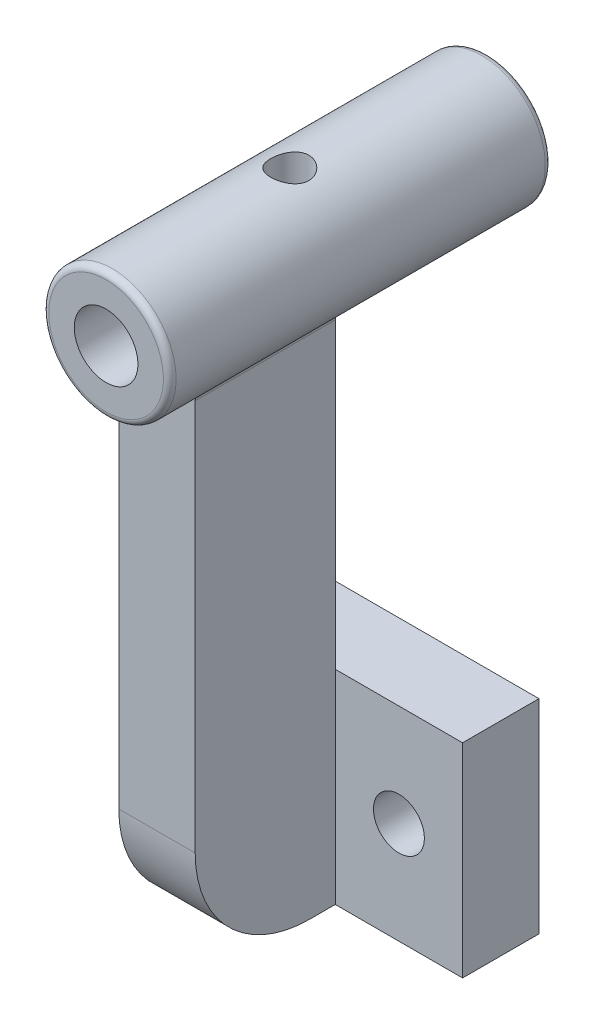
ISO-10303-21;
HEADER;
FILE_DESCRIPTION(('STEP AP214'),'2;1');
FILE_NAME('part.step','',(''),(''),'','','');
FILE_SCHEMA(('AUTOMOTIVE_DESIGN { 1 0 10303 214 1 1 1 1 }'));
ENDSEC;
DATA;
#1=APPLICATION_CONTEXT('core data for automotive mechanical design processes');
#2=APPLICATION_PROTOCOL_DEFINITION('international standard','automotive_design',2000,#1);
#3=PRODUCT_CONTEXT('',#1,'mechanical');
#4=PRODUCT('Part','Part','',(#3));
#5=PRODUCT_RELATED_PRODUCT_CATEGORY('part','',(#4));
#6=PRODUCT_DEFINITION_FORMATION('','',#4);
#7=PRODUCT_DEFINITION_CONTEXT('part definition',#1,'design');
#8=PRODUCT_DEFINITION('design','',#6,#7);
#9=PRODUCT_DEFINITION_SHAPE('','',#8);
#10=(LENGTH_UNIT() NAMED_UNIT(*) SI_UNIT(.MILLI.,.METRE.));
#11=(NAMED_UNIT(*) PLANE_ANGLE_UNIT() SI_UNIT($,.RADIAN.));
#12=(NAMED_UNIT(*) SI_UNIT($,.STERADIAN.) SOLID_ANGLE_UNIT());
#13=UNCERTAINTY_MEASURE_WITH_UNIT(LENGTH_MEASURE(1.E-05),#10,'distance_accuracy_value','');
#14=(GEOMETRIC_REPRESENTATION_CONTEXT(3) GLOBAL_UNCERTAINTY_ASSIGNED_CONTEXT((#13)) GLOBAL_UNIT_ASSIGNED_CONTEXT((#10,
#11,#12)) REPRESENTATION_CONTEXT('',''));
#15=CARTESIAN_POINT('',(0.,0.,0.));
#16=DIRECTION('',(0.,0.,1.));
#17=DIRECTION('',(1.,0.,0.));
#18=AXIS2_PLACEMENT_3D('',#15,#16,#17);
#19=CARTESIAN_POINT('',(0.,0.,6.));
#20=DIRECTION('',(0.,0.,1.));
#21=DIRECTION('',(1.,0.,0.));
#22=AXIS2_PLACEMENT_3D('',#19,#20,#21);
#23=PLANE('',#22);
#24=CARTESIAN_POINT('',(-8.,8.,6.));
#25=DIRECTION('',(0.,0.,1.));
#26=DIRECTION('',(1.,0.,0.));
#27=AXIS2_PLACEMENT_3D('',#24,#25,#26);
#28=CIRCLE('',#27,2.);
#29=CARTESIAN_POINT('',(-6.,8.,6.));
#30=VERTEX_POINT('',#29);
#31=EDGE_CURVE('E179',#30,#30,#28,.T.);
#32=ORIENTED_EDGE('',*,*,#31,.F.);
#33=EDGE_LOOP('',(#32));
#34=FACE_BOUND('',#33,.T.);
#35=DIRECTION('',(-1.,0.,0.));
#36=VECTOR('',#35,1.);
#37=CARTESIAN_POINT('',(0.,0.,6.));
#38=LINE('',#37,#36);
#39=CARTESIAN_POINT('',(-3.,0.,6.));
#40=VERTEX_POINT('',#39);
#41=CARTESIAN_POINT('',(-13.,0.,6.));
#42=VERTEX_POINT('',#41);
#43=EDGE_CURVE('E191',#40,#42,#38,.T.);
#44=ORIENTED_EDGE('',*,*,#43,.F.);
#45=DIRECTION('',(0.,1.,0.));
#46=VECTOR('',#45,1.);
#47=CARTESIAN_POINT('',(-3.,0.,6.));
#48=LINE('',#47,#46);
#49=CARTESIAN_POINT('',(-3.,16.,6.));
#50=VERTEX_POINT('',#49);
#51=EDGE_CURVE('E169',#40,#50,#48,.T.);
#52=ORIENTED_EDGE('',*,*,#51,.T.);
#53=DIRECTION('',(-1.,0.,0.));
#54=VECTOR('',#53,1.);
#55=CARTESIAN_POINT('',(0.,16.,6.));
#56=LINE('',#55,#54);
#57=CARTESIAN_POINT('',(-13.,16.,6.));
#58=VERTEX_POINT('',#57);
#59=EDGE_CURVE('E182',#50,#58,#56,.T.);
#60=ORIENTED_EDGE('',*,*,#59,.T.);
#61=DIRECTION('',(0.,-1.,0.));
#62=VECTOR('',#61,1.);
#63=CARTESIAN_POINT('',(-13.,0.,6.));
#64=LINE('',#63,#62);
#65=EDGE_CURVE('E187',#58,#42,#64,.T.);
#66=ORIENTED_EDGE('',*,*,#65,.T.);
#67=EDGE_LOOP('',(#44,#52,#60,#66));
#68=FACE_BOUND('',#67,.T.);
#69=ADVANCED_FACE('F47',(#34,#68),#23,.T.);
#70=CARTESIAN_POINT('',(0.,16.,6.));
#71=DIRECTION('',(0.,-1.,0.));
#72=DIRECTION('',(1.,0.,0.));
#73=AXIS2_PLACEMENT_3D('',#70,#71,#72);
#74=PLANE('',#73);
#75=DIRECTION('',(-1.,0.,0.));
#76=VECTOR('',#75,1.);
#77=CARTESIAN_POINT('',(0.,16.,0.));
#78=LINE('',#77,#76);
#79=CARTESIAN_POINT('',(13.,16.,0.));
#80=VERTEX_POINT('',#79);
#81=CARTESIAN_POINT('',(-13.,16.,0.));
#82=VERTEX_POINT('',#81);
#83=EDGE_CURVE('E203',#80,#82,#78,.T.);
#84=ORIENTED_EDGE('',*,*,#83,.T.);
#85=DIRECTION('',(0.,0.,-1.));
#86=VECTOR('',#85,1.);
#87=CARTESIAN_POINT('',(-13.,16.,6.));
#88=LINE('',#87,#86);
#89=EDGE_CURVE('E222',#58,#82,#88,.T.);
#90=ORIENTED_EDGE('',*,*,#89,.F.);
#91=ORIENTED_EDGE('',*,*,#59,.F.);
#92=CARTESIAN_POINT('',(3.,16.,6.));
#93=VERTEX_POINT('',#92);
#94=EDGE_CURVE('E188',#93,#50,#56,.T.);
#95=ORIENTED_EDGE('',*,*,#94,.F.);
#96=CARTESIAN_POINT('',(13.,16.,6.));
#97=VERTEX_POINT('',#96);
#98=EDGE_CURVE('E184',#97,#93,#56,.T.);
#99=ORIENTED_EDGE('',*,*,#98,.F.);
#100=DIRECTION('',(0.,0.,-1.));
#101=VECTOR('',#100,1.);
#102=CARTESIAN_POINT('',(13.,16.,6.));
#103=LINE('',#102,#101);
#104=EDGE_CURVE('E200',#97,#80,#103,.T.);
#105=ORIENTED_EDGE('',*,*,#104,.T.);
#106=EDGE_LOOP('',(#84,#90,#91,#95,#99,#105));
#107=FACE_BOUND('',#106,.T.);
#108=ADVANCED_FACE('F271',(#107),#74,.F.);
#109=CARTESIAN_POINT('',(-13.,0.,6.));
#110=DIRECTION('',(1.,0.,0.));
#111=DIRECTION('',(0.,1.,0.));
#112=AXIS2_PLACEMENT_3D('',#109,#110,#111);
#113=PLANE('',#112);
#114=DIRECTION('',(0.,-1.,0.));
#115=VECTOR('',#114,1.);
#116=CARTESIAN_POINT('',(-13.,0.,0.));
#117=LINE('',#116,#115);
#118=CARTESIAN_POINT('',(-13.,0.,0.));
#119=VERTEX_POINT('',#118);
#120=EDGE_CURVE('E206',#82,#119,#117,.T.);
#121=ORIENTED_EDGE('',*,*,#120,.T.);
#122=DIRECTION('',(0.,0.,-1.));
#123=VECTOR('',#122,1.);
#124=CARTESIAN_POINT('',(-13.,0.,6.));
#125=LINE('',#124,#123);
#126=EDGE_CURVE('E220',#42,#119,#125,.T.);
#127=ORIENTED_EDGE('',*,*,#126,.F.);
#128=ORIENTED_EDGE('',*,*,#65,.F.);
#129=ORIENTED_EDGE('',*,*,#89,.T.);
#130=EDGE_LOOP('',(#121,#127,#128,#129));
#131=FACE_BOUND('',#130,.T.);
#132=ADVANCED_FACE('F289',(#131),#113,.F.);
#133=CARTESIAN_POINT('',(0.,0.,6.));
#134=DIRECTION('',(0.,-1.,0.));
#135=DIRECTION('',(1.,0.,0.));
#136=AXIS2_PLACEMENT_3D('',#133,#134,#135);
#137=PLANE('',#136);
#138=DIRECTION('',(-1.,0.,0.));
#139=VECTOR('',#138,1.);
#140=CARTESIAN_POINT('',(0.,0.,0.));
#141=LINE('',#140,#139);
#142=CARTESIAN_POINT('',(13.,0.,0.));
#143=VERTEX_POINT('',#142);
#144=EDGE_CURVE('E209',#143,#119,#141,.T.);
#145=ORIENTED_EDGE('',*,*,#144,.F.);
#146=DIRECTION('',(0.,0.,-1.));
#147=VECTOR('',#146,1.);
#148=CARTESIAN_POINT('',(13.,0.,6.));
#149=LINE('',#148,#147);
#150=CARTESIAN_POINT('',(13.,0.,6.));
#151=VERTEX_POINT('',#150);
#152=EDGE_CURVE('E218',#151,#143,#149,.T.);
#153=ORIENTED_EDGE('',*,*,#152,.F.);
#154=CARTESIAN_POINT('',(3.,0.,6.));
#155=VERTEX_POINT('',#154);
#156=EDGE_CURVE('E192',#151,#155,#38,.T.);
#157=ORIENTED_EDGE('',*,*,#156,.T.);
#158=DIRECTION('',(0.,0.,-1.));
#159=VECTOR('',#158,1.);
#160=CARTESIAN_POINT('',(3.,0.,6.));
#161=LINE('',#160,#159);
#162=CARTESIAN_POINT('',(3.,0.,7.99999999999994));
#163=VERTEX_POINT('',#162);
#164=EDGE_CURVE('E163',#163,#155,#161,.T.);
#165=ORIENTED_EDGE('',*,*,#164,.F.);
#166=DIRECTION('',(1.,0.,0.));
#167=VECTOR('',#166,1.);
#168=CARTESIAN_POINT('',(-3.,0.,7.99999999999994));
#169=LINE('',#168,#167);
#170=CARTESIAN_POINT('',(-3.,0.,7.99999999999994));
#171=VERTEX_POINT('',#170);
#172=EDGE_CURVE('E159',#171,#163,#169,.T.);
#173=ORIENTED_EDGE('',*,*,#172,.F.);
#174=DIRECTION('',(0.,0.,-1.));
#175=VECTOR('',#174,1.);
#176=CARTESIAN_POINT('',(-3.,0.,6.));
#177=LINE('',#176,#175);
#178=EDGE_CURVE('E160',#171,#40,#177,.T.);
#179=ORIENTED_EDGE('',*,*,#178,.T.);
#180=ORIENTED_EDGE('',*,*,#43,.T.);
#181=ORIENTED_EDGE('',*,*,#126,.T.);
#182=EDGE_LOOP('',(#145,#153,#157,#165,#173,#179,#180,#181));
#183=FACE_BOUND('',#182,.T.);
#184=ADVANCED_FACE('F296',(#183),#137,.T.);
#185=CARTESIAN_POINT('',(13.,0.,6.));
#186=DIRECTION('',(-1.,0.,0.));
#187=DIRECTION('',(0.,0.,1.));
#188=AXIS2_PLACEMENT_3D('',#185,#186,#187);
#189=PLANE('',#188);
#190=DIRECTION('',(0.,1.,0.));
#191=VECTOR('',#190,1.);
#192=CARTESIAN_POINT('',(13.,0.,0.));
#193=LINE('',#192,#191);
#194=EDGE_CURVE('E212',#143,#80,#193,.T.);
#195=ORIENTED_EDGE('',*,*,#194,.T.);
#196=ORIENTED_EDGE('',*,*,#104,.F.);
#197=DIRECTION('',(0.,1.,0.));
#198=VECTOR('',#197,1.);
#199=CARTESIAN_POINT('',(13.,0.,6.));
#200=LINE('',#199,#198);
#201=EDGE_CURVE('E195',#151,#97,#200,.T.);
#202=ORIENTED_EDGE('',*,*,#201,.F.);
#203=ORIENTED_EDGE('',*,*,#152,.T.);
#204=EDGE_LOOP('',(#195,#196,#202,#203));
#205=FACE_BOUND('',#204,.T.);
#206=ADVANCED_FACE('F279',(#205),#189,.F.);
#207=CARTESIAN_POINT('',(-8.,8.,6.));
#208=DIRECTION('',(0.,0.,-1.));
#209=DIRECTION('',(-1.,0.,0.));
#210=AXIS2_PLACEMENT_3D('',#207,#208,#209);
#211=CYLINDRICAL_SURFACE('',#210,2.);
#212=ORIENTED_EDGE('',*,*,#31,.T.);
#213=EDGE_LOOP('',(#212));
#214=FACE_BOUND('',#213,.T.);
#215=CARTESIAN_POINT('',(-8.,8.,0.));
#216=DIRECTION('',(0.,0.,1.));
#217=DIRECTION('',(1.,0.,0.));
#218=AXIS2_PLACEMENT_3D('',#215,#216,#217);
#219=CIRCLE('',#218,2.);
#220=CARTESIAN_POINT('',(-6.,8.,0.));
#221=VERTEX_POINT('',#220);
#222=EDGE_CURVE('E177',#221,#221,#219,.T.);
#223=ORIENTED_EDGE('',*,*,#222,.F.);
#224=EDGE_LOOP('',(#223));
#225=FACE_BOUND('',#224,.T.);
#226=ADVANCED_FACE('F328',(#214,#225),#211,.F.);
#227=CARTESIAN_POINT('',(8.,8.,6.));
#228=DIRECTION('',(0.,0.,-1.));
#229=DIRECTION('',(-1.,0.,0.));
#230=AXIS2_PLACEMENT_3D('',#227,#228,#229);
#231=CYLINDRICAL_SURFACE('',#230,2.);
#232=CARTESIAN_POINT('',(8.,8.,6.));
#233=DIRECTION('',(0.,0.,1.));
#234=DIRECTION('',(1.,0.,0.));
#235=AXIS2_PLACEMENT_3D('',#232,#233,#234);
#236=CIRCLE('',#235,2.);
#237=CARTESIAN_POINT('',(10.,8.,6.));
#238=VERTEX_POINT('',#237);
#239=EDGE_CURVE('E197',#238,#238,#236,.T.);
#240=ORIENTED_EDGE('',*,*,#239,.T.);
#241=EDGE_LOOP('',(#240));
#242=FACE_BOUND('',#241,.T.);
#243=CARTESIAN_POINT('',(8.,8.,0.));
#244=DIRECTION('',(0.,0.,1.));
#245=DIRECTION('',(1.,0.,0.));
#246=AXIS2_PLACEMENT_3D('',#243,#244,#245);
#247=CIRCLE('',#246,2.);
#248=CARTESIAN_POINT('',(10.,8.,0.));
#249=VERTEX_POINT('',#248);
#250=EDGE_CURVE('E183',#249,#249,#247,.T.);
#251=ORIENTED_EDGE('',*,*,#250,.F.);
#252=EDGE_LOOP('',(#251));
#253=FACE_BOUND('',#252,.T.);
#254=ADVANCED_FACE('F321',(#242,#253),#231,.F.);
#255=DIRECTION('',(0.,1.,0.));
#256=VECTOR('',#255,1.);
#257=CARTESIAN_POINT('',(3.,0.,6.));
#258=LINE('',#257,#256);
#259=EDGE_CURVE('E149',#155,#93,#258,.T.);
#260=ORIENTED_EDGE('',*,*,#259,.F.);
#261=ORIENTED_EDGE('',*,*,#156,.F.);
#262=ORIENTED_EDGE('',*,*,#201,.T.);
#263=ORIENTED_EDGE('',*,*,#98,.T.);
#264=EDGE_LOOP('',(#260,#261,#262,#263));
#265=FACE_BOUND('',#264,.T.);
#266=ORIENTED_EDGE('',*,*,#239,.F.);
#267=EDGE_LOOP('',(#266));
#268=FACE_BOUND('',#267,.T.);
#269=ADVANCED_FACE('F274',(#265,#268),#23,.T.);
#270=CARTESIAN_POINT('',(0.,0.,0.));
#271=DIRECTION('',(0.,0.,1.));
#272=DIRECTION('',(1.,0.,0.));
#273=AXIS2_PLACEMENT_3D('',#270,#271,#272);
#274=PLANE('',#273);
#275=ORIENTED_EDGE('',*,*,#222,.T.);
#276=EDGE_LOOP('',(#275));
#277=FACE_BOUND('',#276,.T.);
#278=ORIENTED_EDGE('',*,*,#83,.F.);
#279=ORIENTED_EDGE('',*,*,#194,.F.);
#280=ORIENTED_EDGE('',*,*,#144,.T.);
#281=ORIENTED_EDGE('',*,*,#120,.F.);
#282=EDGE_LOOP('',(#278,#279,#280,#281));
#283=FACE_BOUND('',#282,.T.);
#284=ORIENTED_EDGE('',*,*,#250,.T.);
#285=EDGE_LOOP('',(#284));
#286=FACE_BOUND('',#285,.T.);
#287=ADVANCED_FACE('F283',(#277,#283,#286),#274,.F.);
#288=CARTESIAN_POINT('',(-3.,9.,8.));
#289=DIRECTION('',(1.,0.,0.));
#290=DIRECTION('',(0.,0.,-1.));
#291=AXIS2_PLACEMENT_3D('',#288,#289,#290);
#292=CYLINDRICAL_SURFACE('',#291,9.);
#293=ORIENTED_EDGE('',*,*,#172,.T.);
#294=CARTESIAN_POINT('',(3.,9.,8.));
#295=DIRECTION('',(1.,0.,0.));
#296=DIRECTION('',(0.,0.,1.));
#297=AXIS2_PLACEMENT_3D('',#294,#295,#296);
#298=CIRCLE('',#297,9.);
#299=CARTESIAN_POINT('',(3.,9.,17.));
#300=VERTEX_POINT('',#299);
#301=EDGE_CURVE('E145',#300,#163,#298,.T.);
#302=ORIENTED_EDGE('',*,*,#301,.F.);
#303=DIRECTION('',(1.,0.,0.));
#304=VECTOR('',#303,1.);
#305=CARTESIAN_POINT('',(-3.,9.,17.));
#306=LINE('',#305,#304);
#307=CARTESIAN_POINT('',(-3.,9.,17.));
#308=VERTEX_POINT('',#307);
#309=EDGE_CURVE('E152',#308,#300,#306,.T.);
#310=ORIENTED_EDGE('',*,*,#309,.F.);
#311=CARTESIAN_POINT('',(-3.,9.,8.));
#312=DIRECTION('',(1.,0.,0.));
#313=DIRECTION('',(0.,0.,1.));
#314=AXIS2_PLACEMENT_3D('',#311,#312,#313);
#315=CIRCLE('',#314,9.);
#316=EDGE_CURVE('E173',#308,#171,#315,.T.);
#317=ORIENTED_EDGE('',*,*,#316,.T.);
#318=EDGE_LOOP('',(#293,#302,#310,#317));
#319=FACE_BOUND('',#318,.T.);
#320=ADVANCED_FACE('F162',(#319),#292,.T.);
#321=CARTESIAN_POINT('',(-3.,9.00000000000006,17.));
#322=DIRECTION('',(0.,0.,1.));
#323=DIRECTION('',(1.,0.,0.));
#324=AXIS2_PLACEMENT_3D('',#321,#322,#323);
#325=PLANE('',#324);
#326=CARTESIAN_POINT('',(0.,44.,17.));
#327=DIRECTION('',(0.,0.,1.));
#328=DIRECTION('',(1.,0.,0.));
#329=AXIS2_PLACEMENT_3D('',#326,#327,#328);
#330=CIRCLE('',#329,5.);
#331=CARTESIAN_POINT('',(-3.18181818181818,40.1430539208006,17.));
#332=VERTEX_POINT('',#331);
#333=CARTESIAN_POINT('',(3.18181818181818,40.1430539208006,17.));
#334=VERTEX_POINT('',#333);
#335=EDGE_CURVE('E251',#332,#334,#330,.T.);
#336=ORIENTED_EDGE('',*,*,#335,.F.);
#337=CARTESIAN_POINT('',(-3.5,39.7573593128807,17.));
#338=DIRECTION('',(0.,0.,1.));
#339=DIRECTION('',(1.,0.,0.));
#340=AXIS2_PLACEMENT_3D('',#337,#338,#339);
#341=CIRCLE('',#340,0.5);
#342=CARTESIAN_POINT('',(-3.,39.7573593128807,17.));
#343=VERTEX_POINT('',#342);
#344=EDGE_CURVE('E246',#332,#343,#341,.F.);
#345=ORIENTED_EDGE('',*,*,#344,.T.);
#346=DIRECTION('',(0.,-1.,0.));
#347=VECTOR('',#346,1.);
#348=CARTESIAN_POINT('',(-3.,9.00000000000006,17.));
#349=LINE('',#348,#347);
#350=EDGE_CURVE('E155',#343,#308,#349,.T.);
#351=ORIENTED_EDGE('',*,*,#350,.T.);
#352=ORIENTED_EDGE('',*,*,#309,.T.);
#353=DIRECTION('',(0.,-1.,0.));
#354=VECTOR('',#353,1.);
#355=CARTESIAN_POINT('',(3.,9.00000000000006,17.));
#356=LINE('',#355,#354);
#357=CARTESIAN_POINT('',(3.,39.7573593128807,17.));
#358=VERTEX_POINT('',#357);
#359=EDGE_CURVE('E141',#358,#300,#356,.T.);
#360=ORIENTED_EDGE('',*,*,#359,.F.);
#361=CARTESIAN_POINT('',(3.5,39.7573593128807,17.));
#362=DIRECTION('',(0.,0.,1.));
#363=DIRECTION('',(1.,0.,0.));
#364=AXIS2_PLACEMENT_3D('',#361,#362,#363);
#365=CIRCLE('',#364,0.5);
#366=EDGE_CURVE('E61',#358,#334,#365,.F.);
#367=ORIENTED_EDGE('',*,*,#366,.T.);
#368=EDGE_LOOP('',(#336,#345,#351,#352,#360,#367));
#369=FACE_BOUND('',#368,.T.);
#370=ADVANCED_FACE('F153',(#369),#325,.T.);
#371=CARTESIAN_POINT('',(-3.,44.,6.));
#372=DIRECTION('',(0.,0.,-1.));
#373=DIRECTION('',(-1.,0.,0.));
#374=AXIS2_PLACEMENT_3D('',#371,#372,#373);
#375=PLANE('',#374);
#376=CARTESIAN_POINT('',(0.,44.,6.));
#377=DIRECTION('',(0.,0.,-1.));
#378=DIRECTION('',(-1.,0.,0.));
#379=AXIS2_PLACEMENT_3D('',#376,#377,#378);
#380=CIRCLE('',#379,5.);
#381=CARTESIAN_POINT('',(3.18181818181818,40.1430539208006,6.));
#382=VERTEX_POINT('',#381);
#383=CARTESIAN_POINT('',(-3.18181818181818,40.1430539208006,6.));
#384=VERTEX_POINT('',#383);
#385=EDGE_CURVE('E255',#382,#384,#380,.T.);
#386=ORIENTED_EDGE('',*,*,#385,.F.);
#387=CARTESIAN_POINT('',(3.5,39.7573593128807,6.));
#388=DIRECTION('',(0.,0.,-1.));
#389=DIRECTION('',(-1.,0.,0.));
#390=AXIS2_PLACEMENT_3D('',#387,#388,#389);
#391=CIRCLE('',#390,0.5);
#392=CARTESIAN_POINT('',(3.,39.7573593128807,6.));
#393=VERTEX_POINT('',#392);
#394=EDGE_CURVE('E11',#382,#393,#391,.F.);
#395=ORIENTED_EDGE('',*,*,#394,.T.);
#396=EDGE_CURVE('E257',#93,#393,#258,.T.);
#397=ORIENTED_EDGE('',*,*,#396,.F.);
#398=ORIENTED_EDGE('',*,*,#94,.T.);
#399=CARTESIAN_POINT('',(-3.,39.7573593128807,6.));
#400=VERTEX_POINT('',#399);
#401=EDGE_CURVE('E165',#50,#400,#48,.T.);
#402=ORIENTED_EDGE('',*,*,#401,.T.);
#403=CARTESIAN_POINT('',(-3.5,39.7573593128807,6.));
#404=DIRECTION('',(0.,0.,-1.));
#405=DIRECTION('',(-1.,0.,0.));
#406=AXIS2_PLACEMENT_3D('',#403,#404,#405);
#407=CIRCLE('',#406,0.5);
#408=EDGE_CURVE('E248',#400,#384,#407,.F.);
#409=ORIENTED_EDGE('',*,*,#408,.T.);
#410=EDGE_LOOP('',(#386,#395,#397,#398,#402,#409));
#411=FACE_BOUND('',#410,.T.);
#412=ADVANCED_FACE('F301',(#411),#375,.T.);
#413=CARTESIAN_POINT('',(-3.,9.,8.));
#414=DIRECTION('',(-1.,0.,0.));
#415=DIRECTION('',(0.,0.,1.));
#416=AXIS2_PLACEMENT_3D('',#413,#414,#415);
#417=PLANE('',#416);
#418=ORIENTED_EDGE('',*,*,#350,.F.);
#419=DIRECTION('',(0.,0.,1.));
#420=VECTOR('',#419,1.);
#421=CARTESIAN_POINT('',(-3.,39.7573593128807,6.));
#422=LINE('',#421,#420);
#423=EDGE_CURVE('E243',#343,#400,#422,.F.);
#424=ORIENTED_EDGE('',*,*,#423,.T.);
#425=ORIENTED_EDGE('',*,*,#401,.F.);
#426=ORIENTED_EDGE('',*,*,#51,.F.);
#427=ORIENTED_EDGE('',*,*,#178,.F.);
#428=ORIENTED_EDGE('',*,*,#316,.F.);
#429=EDGE_LOOP('',(#418,#424,#425,#426,#427,#428));
#430=FACE_BOUND('',#429,.T.);
#431=ADVANCED_FACE('F294',(#430),#417,.T.);
#432=CARTESIAN_POINT('',(3.,9.,8.));
#433=DIRECTION('',(-1.,0.,0.));
#434=DIRECTION('',(0.,0.,1.));
#435=AXIS2_PLACEMENT_3D('',#432,#433,#434);
#436=PLANE('',#435);
#437=ORIENTED_EDGE('',*,*,#396,.T.);
#438=DIRECTION('',(0.,0.,-1.));
#439=VECTOR('',#438,1.);
#440=CARTESIAN_POINT('',(3.,39.7573593128807,8.));
#441=LINE('',#440,#439);
#442=EDGE_CURVE('E147',#393,#358,#441,.F.);
#443=ORIENTED_EDGE('',*,*,#442,.T.);
#444=ORIENTED_EDGE('',*,*,#359,.T.);
#445=ORIENTED_EDGE('',*,*,#301,.T.);
#446=ORIENTED_EDGE('',*,*,#164,.T.);
#447=ORIENTED_EDGE('',*,*,#259,.T.);
#448=EDGE_LOOP('',(#437,#443,#444,#445,#446,#447));
#449=FACE_BOUND('',#448,.T.);
#450=ADVANCED_FACE('F143',(#449),#436,.F.);
#451=CARTESIAN_POINT('',(0.,44.,21.));
#452=DIRECTION('',(0.,0.,-1.));
#453=DIRECTION('',(-1.,0.,0.));
#454=AXIS2_PLACEMENT_3D('',#451,#452,#453);
#455=CYLINDRICAL_SURFACE('',#454,5.);
#456=CARTESIAN_POINT('',(0.,49.,8.06987902285776));
#457=CARTESIAN_POINT('',(0.0822886127532998,48.9999992925055,8.06987802537287));
#458=CARTESIAN_POINT('',(0.164587318351529,48.9979491569395,8.06308515923379));
#459=CARTESIAN_POINT('',(0.32678812530488,48.9899710559369,8.03615766863566));
#460=CARTESIAN_POINT('',(0.406689504411419,48.9840419338969,8.01601906483442));
#461=CARTESIAN_POINT('',(0.561732707754526,48.9689555250184,7.96313300594749));
#462=CARTESIAN_POINT('',(0.636881364395372,48.9598030025043,7.93040415323882));
#463=CARTESIAN_POINT('',(0.78062418105313,48.9392210923764,7.85334292980192));
#464=CARTESIAN_POINT('',(0.849217467469668,48.9277914019207,7.80900901546234));
#465=CARTESIAN_POINT('',(0.979871797183744,48.9035073719277,7.70865501538509));
#466=CARTESIAN_POINT('',(1.04171807124434,48.8906238365704,7.65236239697184));
#467=CARTESIAN_POINT('',(1.15524920923324,48.8650583421044,7.53026979294757));
#468=CARTESIAN_POINT('',(1.20693236327441,48.852376417245,7.4644682107328));
#469=CARTESIAN_POINT('',(1.29980037723707,48.8283411399377,7.32340826982014));
#470=CARTESIAN_POINT('',(1.34072309022213,48.8170240666387,7.24797056186702));
#471=CARTESIAN_POINT('',(1.4092139477476,48.7974362039403,7.09088976862747));
#472=CARTESIAN_POINT('',(1.43678529919973,48.7891646831331,7.00924817892978));
#473=CARTESIAN_POINT('',(1.47701633682651,48.7769087083843,6.8444887567273));
#474=CARTESIAN_POINT('',(1.49007196234677,48.7728106932453,6.76147627899381));
#475=CARTESIAN_POINT('',(1.50213730614672,48.7690278974977,6.59434586664099));
#476=CARTESIAN_POINT('',(1.50115042761078,48.7693420476057,6.51022820479867));
#477=CARTESIAN_POINT('',(1.48546977199811,48.7742474406778,6.34649511424927));
#478=CARTESIAN_POINT('',(1.47127205262685,48.7786838859914,6.26682677249552));
#479=CARTESIAN_POINT('',(1.43037420427056,48.7910835622862,6.1110592365843));
#480=CARTESIAN_POINT('',(1.40367284141641,48.7990471413235,6.03496039548343));
#481=CARTESIAN_POINT('',(1.33816026653681,48.8177273307497,5.88727867319702));
#482=CARTESIAN_POINT('',(1.29918816934642,48.8284801611595,5.8157719389025));
#483=CARTESIAN_POINT('',(1.21035222588683,48.8515098700006,5.68014700084757));
#484=CARTESIAN_POINT('',(1.16048574002588,48.8637871174699,5.61603059344398));
#485=CARTESIAN_POINT('',(1.04881290765546,48.8891101129794,5.49419283209574));
#486=CARTESIAN_POINT('',(0.98659490746697,48.902166543105,5.43685035882809));
#487=CARTESIAN_POINT('',(0.853263259313965,48.9271224406326,5.33332503879351));
#488=CARTESIAN_POINT('',(0.782149051860885,48.9390218351841,5.28714289444333));
#489=CARTESIAN_POINT('',(0.6323550383428,48.9604316006947,5.20701910039303));
#490=CARTESIAN_POINT('',(0.553627749747948,48.9699254366831,5.1731615066079));
#491=CARTESIAN_POINT('',(0.391245415603517,48.9853352183222,5.11927943275813));
#492=CARTESIAN_POINT('',(0.30759175158958,48.99125216187,5.09925109432527));
#493=CARTESIAN_POINT('',(0.140952242668331,48.9986836464354,5.07422684495837));
#494=CARTESIAN_POINT('',(0.0580500976011861,49.0003485041779,5.06871743705615));
#495=CARTESIAN_POINT('',(-0.107499605823384,48.9995292324176,5.07144817856984));
#496=CARTESIAN_POINT('',(-0.190147196690781,48.9970456567776,5.0796864925092));
#497=CARTESIAN_POINT('',(-0.350903605309697,48.9883069698716,5.10926363396926));
#498=CARTESIAN_POINT('',(-0.429072772614169,48.9821382979942,5.13030241043863));
#499=CARTESIAN_POINT('',(-0.580754638954522,48.9667434784153,5.18452225563596));
#500=CARTESIAN_POINT('',(-0.654266777025584,48.9575169632108,5.21770478389562));
#501=CARTESIAN_POINT('',(-0.796437189461052,48.9366965435132,5.29613218833889));
#502=CARTESIAN_POINT('',(-0.86494382619967,48.9250528082968,5.34163836380573));
#503=CARTESIAN_POINT('',(-0.993523307980146,48.9007346876432,5.44310377691057));
#504=CARTESIAN_POINT('',(-1.05359403235593,48.8880600443108,5.49906563474543));
#505=CARTESIAN_POINT('',(-1.16585744551027,48.8625317186914,5.62226633122711));
#506=CARTESIAN_POINT('',(-1.21768481231503,48.8496882503327,5.6898408986295));
#507=CARTESIAN_POINT('',(-1.30928995072153,48.8257651523846,5.83300696187129));
#508=CARTESIAN_POINT('',(-1.34906803829472,48.8146854765465,5.90859824741598));
#509=CARTESIAN_POINT('',(-1.41517347127168,48.7956718961506,6.06541151411245));
#510=CARTESIAN_POINT('',(-1.4415634693705,48.7877233784383,6.14660520939435));
#511=CARTESIAN_POINT('',(-1.48021730815114,48.7759159436279,6.31256699178924));
#512=CARTESIAN_POINT('',(-1.49248598978779,48.772055625083,6.39733384364543));
#513=CARTESIAN_POINT('',(-1.50221984485059,48.7689997249609,6.56424054123399));
#514=CARTESIAN_POINT('',(-1.5002805530849,48.7696164744275,6.64634267387535));
#515=CARTESIAN_POINT('',(-1.48307505444813,48.7749940128829,6.80899312623056));
#516=CARTESIAN_POINT('',(-1.46780938124716,48.7797546359255,6.88954150803411));
#517=CARTESIAN_POINT('',(-1.42476888804136,48.7927576367039,7.04582442200061));
#518=CARTESIAN_POINT('',(-1.39715175507068,48.8009560454596,7.12160631021945));
#519=CARTESIAN_POINT('',(-1.33031507121129,48.8199027890914,7.26752146167548));
#520=CARTESIAN_POINT('',(-1.29109329962876,48.8306516119431,7.33765364049852));
#521=CARTESIAN_POINT('',(-1.20048763805072,48.8539767642583,7.47304213938487));
#522=CARTESIAN_POINT('',(-1.14871276092994,48.866605401638,7.53802778411817));
#523=CARTESIAN_POINT('',(-1.03517434629782,48.8920132045003,7.65858152116562));
#524=CARTESIAN_POINT('',(-0.973408217134499,48.904792408239,7.71414716232552));
#525=CARTESIAN_POINT('',(-0.839465762183247,48.9295093657065,7.81590243515279));
#526=CARTESIAN_POINT('',(-0.767037885790606,48.9414115976567,7.86177046971325));
#527=CARTESIAN_POINT('',(-0.615141373983528,48.9626068045581,7.94061419276178));
#528=CARTESIAN_POINT('',(-0.535676052998954,48.9719009993107,7.97359591113227));
#529=CARTESIAN_POINT('',(-0.38075771265528,48.986021749693,8.02277429851051));
#530=CARTESIAN_POINT('',(-0.305786961954233,48.9912202738107,8.04039069574101));
#531=CARTESIAN_POINT('',(-0.153880195230778,48.9982094449449,8.06394254809933));
#532=CARTESIAN_POINT('',(-0.0769445098581391,49.0000006615474,8.06987995556258));
#533=CARTESIAN_POINT('',(0.,49.,8.06987902285776));
#534=B_SPLINE_CURVE_WITH_KNOTS('',3,(#456,#457,#458,#459,#460,#461,#462,#463,#464,#465,#466,
#467,#468,#469,#470,#471,#472,#473,#474,#475,#476,#477,#478,#479,#480,#481,#482,#483,#484,#485,
#486,#487,#488,#489,#490,#491,#492,#493,#494,#495,#496,#497,#498,#499,#500,#501,#502,#503,#504,
#505,#506,#507,#508,#509,#510,#511,#512,#513,#514,#515,#516,#517,#518,#519,#520,#521,#522,#523,
#524,#525,#526,#527,#528,#529,#530,#531,#532,#533),.UNSPECIFIED.,.T.,.F.,(4,2,2,2,2,2,2,2,2,2,2,
2,2,2,2,2,2,2,2,2,2,2,2,2,2,2,2,2,2,2,2,2,2,2,2,2,2,2,4),(0.,0.24658320361261,0.493239964845999,
0.739533676300873,0.9858601644127,1.23855602948191,1.49129437288633,1.74971481004109,
2.00807314543223,2.25919689356599,2.51025978319089,2.75226016697676,2.99428443658001,
3.23962426447119,3.48502360158555,3.74067104048166,3.99633456531071,4.25371046881688,
4.51101453528807,4.75908809438544,5.00712853550326,5.24956746682326,5.49203554593728,
5.74011305702907,5.9882528200019,6.24540400322818,6.5025484425268,6.75847814951251,
7.01432009460282,7.25950155466942,7.50467319661599,7.7468004040272,7.98897397553106,
8.23996925679929,8.49102974897501,8.74942996156669,9.00770911595234,9.23831691930458,
9.46888616948873),.UNSPECIFIED.);
#535=CARTESIAN_POINT('',(0.,49.,8.06987902285776));
#536=VERTEX_POINT('',#535);
#537=EDGE_CURVE('E372',#536,#536,#534,.T.);
#538=ORIENTED_EDGE('',*,*,#537,.F.);
#539=EDGE_LOOP('',(#538));
#540=FACE_BOUND('',#539,.T.);
#541=CARTESIAN_POINT('',(0.,44.,20.5));
#542=DIRECTION('',(0.,0.,-1.));
#543=DIRECTION('',(-1.,0.,0.));
#544=AXIS2_PLACEMENT_3D('',#541,#542,#543);
#545=CIRCLE('',#544,5.);
#546=CARTESIAN_POINT('',(-5.,44.,20.5));
#547=VERTEX_POINT('',#546);
#548=EDGE_CURVE('E228',#547,#547,#545,.T.);
#549=ORIENTED_EDGE('',*,*,#548,.T.);
#550=EDGE_LOOP('',(#549));
#551=FACE_BOUND('',#550,.T.);
#552=CARTESIAN_POINT('',(0.,44.,-8.5));
#553=DIRECTION('',(0.,0.,-1.));
#554=DIRECTION('',(-1.,0.,0.));
#555=AXIS2_PLACEMENT_3D('',#552,#553,#554);
#556=CIRCLE('',#555,5.);
#557=CARTESIAN_POINT('',(-5.,44.,-8.5));
#558=VERTEX_POINT('',#557);
#559=EDGE_CURVE('E225',#558,#558,#556,.F.);
#560=ORIENTED_EDGE('',*,*,#559,.T.);
#561=EDGE_LOOP('',(#560));
#562=FACE_BOUND('',#561,.T.);
#563=DIRECTION('',(0.,0.,-1.));
#564=VECTOR('',#563,1.);
#565=CARTESIAN_POINT('',(-3.18181818181818,40.1430539208006,21.));
#566=LINE('',#565,#564);
#567=EDGE_CURVE('E240',#384,#332,#566,.F.);
#568=ORIENTED_EDGE('',*,*,#567,.T.);
#569=ORIENTED_EDGE('',*,*,#335,.T.);
#570=DIRECTION('',(0.,0.,-1.));
#571=VECTOR('',#570,1.);
#572=CARTESIAN_POINT('',(3.18181818181818,40.1430539208006,21.));
#573=LINE('',#572,#571);
#574=EDGE_CURVE('E237',#334,#382,#573,.T.);
#575=ORIENTED_EDGE('',*,*,#574,.T.);
#576=ORIENTED_EDGE('',*,*,#385,.T.);
#577=EDGE_LOOP('',(#568,#569,#575,#576));
#578=FACE_BOUND('',#577,.T.);
#579=ADVANCED_FACE('F254',(#540,#551,#562,#578),#455,.T.);
#580=CARTESIAN_POINT('',(0.,44.,21.));
#581=DIRECTION('',(0.,0.,-1.));
#582=DIRECTION('',(-1.,0.,0.));
#583=AXIS2_PLACEMENT_3D('',#580,#581,#582);
#584=PLANE('',#583);
#585=CARTESIAN_POINT('',(0.,44.,21.));
#586=DIRECTION('',(0.,0.,-1.));
#587=DIRECTION('',(-1.,0.,0.));
#588=AXIS2_PLACEMENT_3D('',#585,#586,#587);
#589=CIRCLE('',#588,4.5);
#590=CARTESIAN_POINT('',(-4.5,44.,21.));
#591=VERTEX_POINT('',#590);
#592=EDGE_CURVE('E231',#591,#591,#589,.F.);
#593=ORIENTED_EDGE('',*,*,#592,.T.);
#594=EDGE_LOOP('',(#593));
#595=FACE_BOUND('',#594,.T.);
#596=CARTESIAN_POINT('',(0.,44.,21.));
#597=DIRECTION('',(0.,0.,-1.));
#598=DIRECTION('',(-1.,0.,0.));
#599=AXIS2_PLACEMENT_3D('',#596,#597,#598);
#600=CIRCLE('',#599,2.5);
#601=CARTESIAN_POINT('',(-2.5,44.,21.));
#602=VERTEX_POINT('',#601);
#603=EDGE_CURVE('E259',#602,#602,#600,.T.);
#604=ORIENTED_EDGE('',*,*,#603,.T.);
#605=EDGE_LOOP('',(#604));
#606=FACE_BOUND('',#605,.T.);
#607=ADVANCED_FACE('F382',(#595,#606),#584,.F.);
#608=CARTESIAN_POINT('',(0.,44.,-9.));
#609=DIRECTION('',(0.,0.,-1.));
#610=DIRECTION('',(-1.,0.,0.));
#611=AXIS2_PLACEMENT_3D('',#608,#609,#610);
#612=PLANE('',#611);
#613=CARTESIAN_POINT('',(0.,44.,-9.));
#614=DIRECTION('',(0.,0.,-1.));
#615=DIRECTION('',(-1.,0.,0.));
#616=AXIS2_PLACEMENT_3D('',#613,#614,#615);
#617=CIRCLE('',#616,4.5);
#618=CARTESIAN_POINT('',(-4.5,44.,-9.));
#619=VERTEX_POINT('',#618);
#620=EDGE_CURVE('E234',#619,#619,#617,.T.);
#621=ORIENTED_EDGE('',*,*,#620,.T.);
#622=EDGE_LOOP('',(#621));
#623=FACE_BOUND('',#622,.T.);
#624=CARTESIAN_POINT('',(0.,44.,-9.));
#625=DIRECTION('',(0.,0.,-1.));
#626=DIRECTION('',(-1.,0.,0.));
#627=AXIS2_PLACEMENT_3D('',#624,#625,#626);
#628=CIRCLE('',#627,2.5);
#629=CARTESIAN_POINT('',(-2.5,44.,-9.));
#630=VERTEX_POINT('',#629);
#631=EDGE_CURVE('E378',#630,#630,#628,.T.);
#632=ORIENTED_EDGE('',*,*,#631,.F.);
#633=EDGE_LOOP('',(#632));
#634=FACE_BOUND('',#633,.T.);
#635=ADVANCED_FACE('F396',(#623,#634),#612,.T.);
#636=CARTESIAN_POINT('',(0.,44.,21.));
#637=DIRECTION('',(0.,0.,-1.));
#638=DIRECTION('',(-1.,0.,0.));
#639=AXIS2_PLACEMENT_3D('',#636,#637,#638);
#640=CYLINDRICAL_SURFACE('',#639,2.5);
#641=CARTESIAN_POINT('',(0.,46.5,8.06987902285776));
#642=CARTESIAN_POINT('',(0.0767298334620156,46.4999962578973,8.06987493184788));
#643=CARTESIAN_POINT('',(0.153582320644178,46.4964290461501,8.06395035193149));
#644=CARTESIAN_POINT('',(0.304975509530678,46.4824990360857,8.04055470334243));
#645=CARTESIAN_POINT('',(0.379510034596046,46.4721194803272,8.02305516100353));
#646=CARTESIAN_POINT('',(0.523751827790836,46.4456155805449,7.9774926616909));
#647=CARTESIAN_POINT('',(0.593481028226565,46.4295197327294,7.9494820646946));
#648=CARTESIAN_POINT('',(0.727030318214658,46.3929536762641,7.88401868971673));
#649=CARTESIAN_POINT('',(0.790851869416382,46.3724845538026,7.84656825588901));
#650=CARTESIAN_POINT('',(0.916299278999314,46.3270536071909,7.76010419614917));
#651=CARTESIAN_POINT('',(0.977384020081414,46.3018679219598,7.71042532750637));
#652=CARTESIAN_POINT('',(1.09088270411891,46.2503043927963,7.60241181902949));
#653=CARTESIAN_POINT('',(1.14328534948112,46.2239250515357,7.54406608567044));
#654=CARTESIAN_POINT('',(1.24444996762974,46.1691106699591,7.41195551236102));
#655=CARTESIAN_POINT('',(1.29197766378809,46.1408201770365,7.33717725187647));
#656=CARTESIAN_POINT('',(1.37361437764896,46.0893830141212,7.17903244961464));
#657=CARTESIAN_POINT('',(1.40774517335159,46.0662280227394,7.09568012661019));
#658=CARTESIAN_POINT('',(1.45440601714221,46.0335462966093,6.94328257220452));
#659=CARTESIAN_POINT('',(1.47016197246826,46.0220788313759,6.87564302424744));
#660=CARTESIAN_POINT('',(1.49216172340475,46.005903082955,6.73807530702739));
#661=CARTESIAN_POINT('',(1.49841734556835,46.0011863964376,6.66815009410326));
#662=CARTESIAN_POINT('',(1.50105508796008,45.9992092246386,6.52786752864042));
#663=CARTESIAN_POINT('',(1.49741783408418,46.0019633701272,6.45750959776456));
#664=CARTESIAN_POINT('',(1.48046060478827,46.0145326144374,6.31860024743017));
#665=CARTESIAN_POINT('',(1.46713334620103,46.0243530243223,6.25005022701031));
#666=CARTESIAN_POINT('',(1.43173921881792,46.0495318694426,6.11734878072965));
#667=CARTESIAN_POINT('',(1.40978748666087,46.0648171165254,6.05315196893327));
#668=CARTESIAN_POINT('',(1.35795061770836,46.0992705135083,5.92918403192963));
#669=CARTESIAN_POINT('',(1.32806257259704,46.1184400862346,5.86941453943383));
#670=CARTESIAN_POINT('',(1.25517983184582,46.1625532726898,5.74489492573495));
#671=CARTESIAN_POINT('',(1.21080724397722,46.1879204337299,5.68110092990283));
#672=CARTESIAN_POINT('',(1.11291092784003,46.2393059976438,5.56120253919074));
#673=CARTESIAN_POINT('',(1.05937845100578,46.2653250026215,5.50510558888125));
#674=CARTESIAN_POINT('',(0.935811834382961,46.3193550495832,5.394266041036));
#675=CARTESIAN_POINT('',(0.864517682704951,46.3471383626853,5.34080171684177));
#676=CARTESIAN_POINT('',(0.712276050458994,46.3977242843398,5.24675697565985));
#677=CARTESIAN_POINT('',(0.631333763943557,46.4205295542552,5.20616966906781));
#678=CARTESIAN_POINT('',(0.4671975852682,46.4573039206615,5.14194684006186));
#679=CARTESIAN_POINT('',(0.384467624173574,46.471739574397,5.11740366714185));
#680=CARTESIAN_POINT('',(0.215047895144634,46.4921884281355,5.08286782545238));
#681=CARTESIAN_POINT('',(0.128363005661314,46.4982117295274,5.07285770510418));
#682=CARTESIAN_POINT('',(-0.0337146143774013,46.5009057037461,5.06837117517945));
#683=CARTESIAN_POINT('',(-0.109042473418722,46.4987352171429,5.07197016777259));
#684=CARTESIAN_POINT('',(-0.257829401986064,46.4877871208705,5.09030487592968));
#685=CARTESIAN_POINT('',(-0.331288509376109,46.4790096451804,5.10504036566357));
#686=CARTESIAN_POINT('',(-0.472574932157616,46.4559479244219,5.14442245567023));
#687=CARTESIAN_POINT('',(-0.540495750928487,46.4418027566255,5.16881937193123));
#688=CARTESIAN_POINT('',(-0.671265749087266,46.4091388086284,5.22655639922303));
#689=CARTESIAN_POINT('',(-0.734113924963911,46.3906191658651,5.25989827420443));
#690=CARTESIAN_POINT('',(-0.860006262823866,46.3484549623736,5.33843600206647));
#691=CARTESIAN_POINT('',(-0.922394150456839,46.3244780273988,5.38450285193616));
#692=CARTESIAN_POINT('',(-1.03902603131014,46.2747426557473,5.48527041634638));
#693=CARTESIAN_POINT('',(-1.09326040273738,46.2489821658636,5.5399811777103));
#694=CARTESIAN_POINT('',(-1.19931996735579,46.1944542390989,5.66478941289492));
#695=CARTESIAN_POINT('',(-1.24991019630915,46.1657324174629,5.73596290832327));
#696=CARTESIAN_POINT('',(-1.33845238915668,46.1121618206671,5.88709504742597));
#697=CARTESIAN_POINT('',(-1.37641766769781,46.0873089799769,5.96704431675055));
#698=CARTESIAN_POINT('',(-1.43142578795776,46.0498490924052,6.11612204516446));
#699=CARTESIAN_POINT('',(-1.4512162533619,46.0357565932873,6.18385933521636));
#700=CARTESIAN_POINT('',(-1.48113663905972,46.0140960574354,6.32241110093787));
#701=CARTESIAN_POINT('',(-1.4912799529763,46.0065189764272,6.39322116718559));
#702=CARTESIAN_POINT('',(-1.50134130416631,45.9990044661627,6.5362559704548));
#703=CARTESIAN_POINT('',(-1.50122089107869,45.9990957644594,6.60848501354481));
#704=CARTESIAN_POINT('',(-1.49066472959327,46.0069771789285,6.75177345846723));
#705=CARTESIAN_POINT('',(-1.48022337215758,46.0147714813882,6.82283220293836));
#706=CARTESIAN_POINT('',(-1.45040174148912,46.0363318524298,6.95836744042995));
#707=CARTESIAN_POINT('',(-1.43147636845351,46.0497921180558,7.02299611716464));
#708=CARTESIAN_POINT('',(-1.38563242076993,46.0810550196015,7.14821627733198));
#709=CARTESIAN_POINT('',(-1.35871083588479,46.0988592904048,7.20880622981832));
#710=CARTESIAN_POINT('',(-1.29289245555732,46.1401299055092,7.33419888007854));
#711=CARTESIAN_POINT('',(-1.25279167675752,46.1640458758264,7.39822012671207));
#712=CARTESIAN_POINT('',(-1.16375698389084,46.2132012703077,7.51925909547505));
#713=CARTESIAN_POINT('',(-1.11481579607797,46.2384417720502,7.57627098501032));
#714=CARTESIAN_POINT('',(-1.00009777425733,46.2922569029148,7.69122997198944));
#715=CARTESIAN_POINT('',(-0.932876819313894,46.3207030866366,7.74781009775395));
#716=CARTESIAN_POINT('',(-0.788462434445578,46.3736542887237,7.84897687872107));
#717=CARTESIAN_POINT('',(-0.711265444501528,46.3981578931093,7.89355923484256));
#718=CARTESIAN_POINT('',(-0.551125230801442,46.4398557865439,7.9676648304315));
#719=CARTESIAN_POINT('',(-0.468430086957202,46.4572507747979,7.99760708778459));
#720=CARTESIAN_POINT('',(-0.297973306118796,46.4836627300125,8.04260371806873));
#721=CARTESIAN_POINT('',(-0.2102320996486,46.4927112587148,8.05771419071475));
#722=CARTESIAN_POINT('',(-0.101558096917527,46.4980200116819,8.06657647756642));
#723=CARTESIAN_POINT('',(-0.0812762590282703,46.4987611465636,8.06781344016385));
#724=CARTESIAN_POINT('',(-0.0406658206871091,46.4997516451737,8.06946526922862));
#725=CARTESIAN_POINT('',(-0.0203372186375678,46.5000009918432,8.06988010717866));
#726=CARTESIAN_POINT('',(0.,46.5,8.06987902285776));
#727=B_SPLINE_CURVE_WITH_KNOTS('',3,(#641,#642,#643,#644,#645,#646,#647,#648,#649,#650,#651,
#652,#653,#654,#655,#656,#657,#658,#659,#660,#661,#662,#663,#664,#665,#666,#667,#668,#669,#670,
#671,#672,#673,#674,#675,#676,#677,#678,#679,#680,#681,#682,#683,#684,#685,#686,#687,#688,#689,
#690,#691,#692,#693,#694,#695,#696,#697,#698,#699,#700,#701,#702,#703,#704,#705,#706,#707,#708,
#709,#710,#711,#712,#713,#714,#715,#716,#717,#718,#719,#720,#721,#722,#723,#724,#725,#726),
.UNSPECIFIED.,.T.,.F.,(4,2,2,2,2,2,2,2,2,2,2,2,2,2,2,2,2,2,2,2,2,2,2,2,2,2,2,2,2,2,2,2,2,2,2,2,
2,2,2,2,2,2,4),(0.,0.230102237548649,0.460772627520011,0.690308884600011,0.919788197992273,
1.16681590732473,1.414162579348,1.69183813189807,1.96906040692091,2.17933829855633,
2.38935420916578,2.59978170870726,2.81036753273872,3.01823267593207,3.22617409809868,
3.47046995225162,3.71500044803674,3.99360957884691,4.27206939275324,4.53296790696559,
4.79355286918235,5.01875602722426,5.24395461863455,5.46367785689771,5.68344445659025,
5.92601365818361,6.16886690081835,6.44336762428009,6.71757792616455,6.93257787314692,
7.14727888733318,7.36278425777432,7.57840681155724,7.78364098331141,7.98895251523034,
8.22578610052285,8.46281544370207,8.73854311775519,9.01436946031985,9.28175654462677,
9.54812832184448,9.60911473335176,9.67010326027639),.UNSPECIFIED.);
#728=CARTESIAN_POINT('',(0.,46.5,8.06987902285776));
#729=VERTEX_POINT('',#728);
#730=EDGE_CURVE('E51',#729,#729,#727,.T.);
#731=ORIENTED_EDGE('',*,*,#730,.T.);
#732=EDGE_LOOP('',(#731));
#733=FACE_BOUND('',#732,.T.);
#734=ORIENTED_EDGE('',*,*,#603,.F.);
#735=EDGE_LOOP('',(#734));
#736=FACE_BOUND('',#735,.T.);
#737=ORIENTED_EDGE('',*,*,#631,.T.);
#738=EDGE_LOOP('',(#737));
#739=FACE_BOUND('',#738,.T.);
#740=ADVANCED_FACE('F347',(#733,#736,#739),#640,.F.);
#741=CARTESIAN_POINT('',(0.,44.,20.5));
#742=DIRECTION('',(0.,0.,-1.));
#743=DIRECTION('',(-1.,0.,0.));
#744=AXIS2_PLACEMENT_3D('',#741,#742,#743);
#745=TOROIDAL_SURFACE('',#744,4.5,0.5);
#746=ORIENTED_EDGE('',*,*,#592,.F.);
#747=EDGE_LOOP('',(#746));
#748=FACE_BOUND('',#747,.T.);
#749=ORIENTED_EDGE('',*,*,#548,.F.);
#750=EDGE_LOOP('',(#749));
#751=FACE_BOUND('',#750,.T.);
#752=ADVANCED_FACE('F343',(#748,#751),#745,.T.);
#753=CARTESIAN_POINT('',(0.,44.,-8.5));
#754=DIRECTION('',(0.,0.,-1.));
#755=DIRECTION('',(-1.,0.,0.));
#756=AXIS2_PLACEMENT_3D('',#753,#754,#755);
#757=TOROIDAL_SURFACE('',#756,4.5,0.5);
#758=ORIENTED_EDGE('',*,*,#559,.F.);
#759=EDGE_LOOP('',(#758));
#760=FACE_BOUND('',#759,.T.);
#761=ORIENTED_EDGE('',*,*,#620,.F.);
#762=EDGE_LOOP('',(#761));
#763=FACE_BOUND('',#762,.T.);
#764=ADVANCED_FACE('F346',(#760,#763),#757,.T.);
#765=CARTESIAN_POINT('',(-3.5,39.7573593128807,21.));
#766=DIRECTION('',(0.,0.,-1.));
#767=DIRECTION('',(-1.,0.,0.));
#768=AXIS2_PLACEMENT_3D('',#765,#766,#767);
#769=CYLINDRICAL_SURFACE('',#768,0.5);
#770=ORIENTED_EDGE('',*,*,#408,.F.);
#771=ORIENTED_EDGE('',*,*,#423,.F.);
#772=ORIENTED_EDGE('',*,*,#344,.F.);
#773=ORIENTED_EDGE('',*,*,#567,.F.);
#774=EDGE_LOOP('',(#770,#771,#772,#773));
#775=FACE_BOUND('',#774,.T.);
#776=ADVANCED_FACE('F300',(#775),#769,.F.);
#777=CARTESIAN_POINT('',(3.5,39.7573593128807,21.));
#778=DIRECTION('',(0.,0.,-1.));
#779=DIRECTION('',(-1.,0.,0.));
#780=AXIS2_PLACEMENT_3D('',#777,#778,#779);
#781=CYLINDRICAL_SURFACE('',#780,0.5);
#782=ORIENTED_EDGE('',*,*,#394,.F.);
#783=ORIENTED_EDGE('',*,*,#574,.F.);
#784=ORIENTED_EDGE('',*,*,#366,.F.);
#785=ORIENTED_EDGE('',*,*,#442,.F.);
#786=EDGE_LOOP('',(#782,#783,#784,#785));
#787=FACE_BOUND('',#786,.T.);
#788=ADVANCED_FACE('F49',(#787),#781,.F.);
#789=CARTESIAN_POINT('',(0.,45.,6.56987902285776));
#790=DIRECTION('',(0.,1.,0.));
#791=DIRECTION('',(0.,0.,1.));
#792=AXIS2_PLACEMENT_3D('',#789,#790,#791);
#793=CYLINDRICAL_SURFACE('',#792,1.5);
#794=ORIENTED_EDGE('',*,*,#537,.T.);
#795=EDGE_LOOP('',(#794));
#796=FACE_BOUND('',#795,.T.);
#797=ORIENTED_EDGE('',*,*,#730,.F.);
#798=EDGE_LOOP('',(#797));
#799=FACE_BOUND('',#798,.T.);
#800=ADVANCED_FACE('F356',(#796,#799),#793,.F.);
#801=CLOSED_SHELL('',(#69,#108,#132,#184,#206,#226,#254,#269,#287,#320,#370,#412,#431,#450,#579,
#607,#635,#740,#752,#764,#776,#788,#800));
#802=MANIFOLD_SOLID_BREP('B2',#801);
#803=ADVANCED_BREP_SHAPE_REPRESENTATION('',(#18,#802),#14);
#804=SHAPE_DEFINITION_REPRESENTATION(#9,#803);
ENDSEC;
END-ISO-10303-21;
